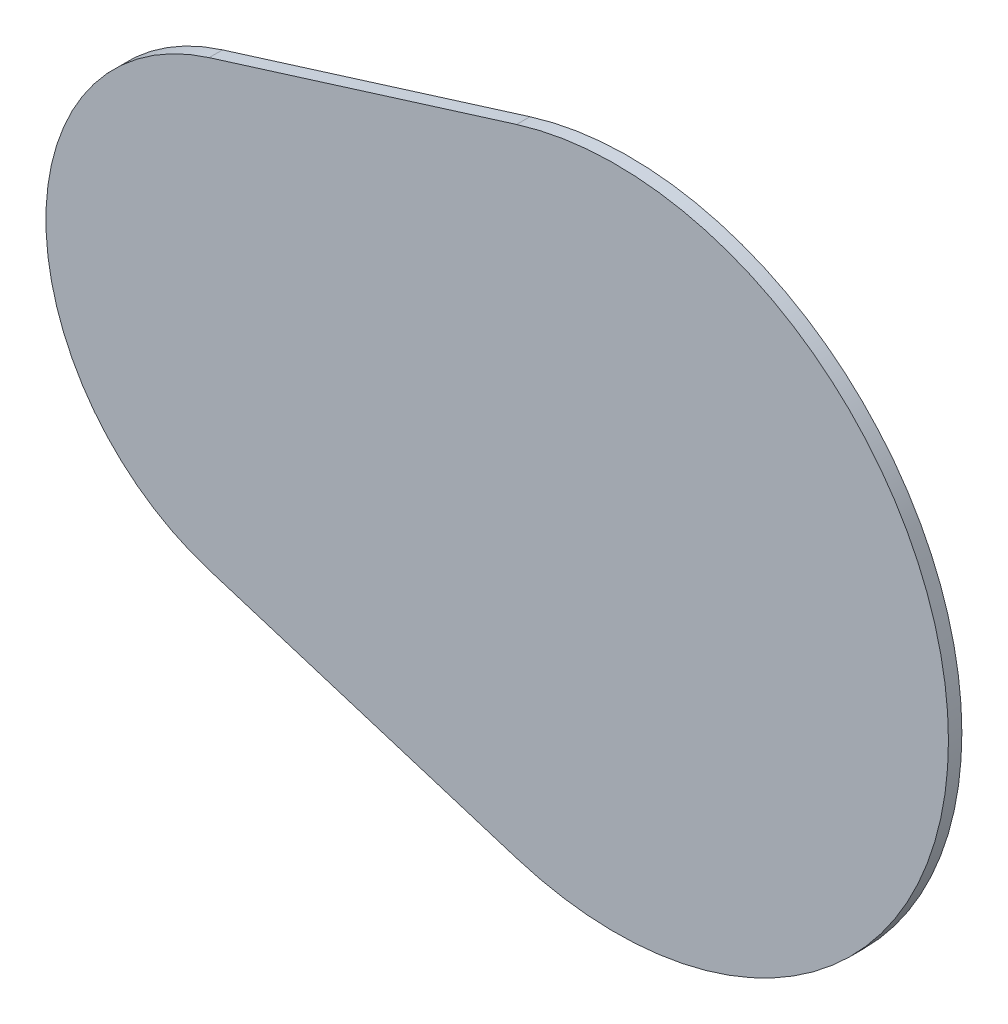
ISO-10303-21;
HEADER;
FILE_DESCRIPTION(('STEP AP214'),'2;1');
FILE_NAME('part.step','',(''),(''),'','','');
FILE_SCHEMA(('AUTOMOTIVE_DESIGN { 1 0 10303 214 1 1 1 1 }'));
ENDSEC;
DATA;
#1=APPLICATION_CONTEXT('core data for automotive mechanical design processes');
#2=APPLICATION_PROTOCOL_DEFINITION('international standard','automotive_design',2000,#1);
#3=PRODUCT_CONTEXT('',#1,'mechanical');
#4=PRODUCT('Part','Part','',(#3));
#5=PRODUCT_RELATED_PRODUCT_CATEGORY('part','',(#4));
#6=PRODUCT_DEFINITION_FORMATION('','',#4);
#7=PRODUCT_DEFINITION_CONTEXT('part definition',#1,'design');
#8=PRODUCT_DEFINITION('design','',#6,#7);
#9=PRODUCT_DEFINITION_SHAPE('','',#8);
#10=(LENGTH_UNIT() NAMED_UNIT(*) SI_UNIT(.MILLI.,.METRE.));
#11=(NAMED_UNIT(*) PLANE_ANGLE_UNIT() SI_UNIT($,.RADIAN.));
#12=(NAMED_UNIT(*) SI_UNIT($,.STERADIAN.) SOLID_ANGLE_UNIT());
#13=UNCERTAINTY_MEASURE_WITH_UNIT(LENGTH_MEASURE(1.E-05),#10,'distance_accuracy_value','');
#14=(GEOMETRIC_REPRESENTATION_CONTEXT(3) GLOBAL_UNCERTAINTY_ASSIGNED_CONTEXT((#13)) GLOBAL_UNIT_ASSIGNED_CONTEXT((#10,
#11,#12)) REPRESENTATION_CONTEXT('',''));
#15=CARTESIAN_POINT('',(0.,0.,0.));
#16=DIRECTION('',(0.,0.,1.));
#17=DIRECTION('',(1.,0.,0.));
#18=AXIS2_PLACEMENT_3D('',#15,#16,#17);
#19=CARTESIAN_POINT('',(0.,0.,1.5875));
#20=DIRECTION('',(0.,0.,-1.));
#21=DIRECTION('',(-1.,0.,0.));
#22=AXIS2_PLACEMENT_3D('',#19,#20,#21);
#23=CYLINDRICAL_SURFACE('',#22,39.37);
#24=CARTESIAN_POINT('',(0.,0.,0.));
#25=DIRECTION('',(0.,0.,1.));
#26=DIRECTION('',(1.,0.,0.));
#27=AXIS2_PLACEMENT_3D('',#24,#25,#26);
#28=CIRCLE('',#27,39.37);
#29=CARTESIAN_POINT('',(-11.7182438196972,-37.5856310547279,0.));
#30=VERTEX_POINT('',#29);
#31=CARTESIAN_POINT('',(-11.7182438196972,37.5856310547279,0.));
#32=VERTEX_POINT('',#31);
#33=EDGE_CURVE('E96',#30,#32,#28,.T.);
#34=ORIENTED_EDGE('',*,*,#33,.T.);
#35=DIRECTION('',(0.,0.,-1.));
#36=VECTOR('',#35,1.);
#37=CARTESIAN_POINT('',(-11.7182438196972,37.5856310547279,1.5875));
#38=LINE('',#37,#36);
#39=CARTESIAN_POINT('',(-11.7182438196972,37.5856310547279,1.5875));
#40=VERTEX_POINT('',#39);
#41=EDGE_CURVE('E11',#40,#32,#38,.T.);
#42=ORIENTED_EDGE('',*,*,#41,.F.);
#43=CARTESIAN_POINT('',(0.,0.,1.5875));
#44=DIRECTION('',(0.,0.,1.));
#45=DIRECTION('',(1.,0.,0.));
#46=AXIS2_PLACEMENT_3D('',#43,#44,#45);
#47=CIRCLE('',#46,39.37);
#48=CARTESIAN_POINT('',(-11.7182438196972,-37.5856310547279,1.5875));
#49=VERTEX_POINT('',#48);
#50=EDGE_CURVE('E84',#49,#40,#47,.T.);
#51=ORIENTED_EDGE('',*,*,#50,.F.);
#52=DIRECTION('',(0.,0.,-1.));
#53=VECTOR('',#52,1.);
#54=CARTESIAN_POINT('',(-11.7182438196972,-37.5856310547279,1.5875));
#55=LINE('',#54,#53);
#56=EDGE_CURVE('E92',#49,#30,#55,.T.);
#57=ORIENTED_EDGE('',*,*,#56,.T.);
#58=EDGE_LOOP('',(#34,#42,#51,#57));
#59=FACE_BOUND('',#58,.T.);
#60=ADVANCED_FACE('F33',(#59),#23,.T.);
#61=CARTESIAN_POINT('',(-11.7182438196972,37.5856310547279,1.5875));
#62=DIRECTION('',(0.297643988308285,-0.954676938143966,0.));
#63=DIRECTION('',(0.954676938143966,0.297643988308285,0.));
#64=AXIS2_PLACEMENT_3D('',#61,#62,#63);
#65=PLANE('',#64);
#66=DIRECTION('',(-0.954676938143966,-0.297643988308285,0.));
#67=VECTOR('',#66,1.);
#68=CARTESIAN_POINT('',(-11.7182438196972,37.5856310547279,0.));
#69=LINE('',#68,#67);
#70=CARTESIAN_POINT('',(-48.0914351629829,26.2453951001821,0.));
#71=VERTEX_POINT('',#70);
#72=EDGE_CURVE('E88',#32,#71,#69,.T.);
#73=ORIENTED_EDGE('',*,*,#72,.T.);
#74=DIRECTION('',(0.,0.,-1.));
#75=VECTOR('',#74,1.);
#76=CARTESIAN_POINT('',(-48.0914351629829,26.2453951001821,1.5875));
#77=LINE('',#76,#75);
#78=CARTESIAN_POINT('',(-48.0914351629829,26.2453951001821,1.5875));
#79=VERTEX_POINT('',#78);
#80=EDGE_CURVE('E41',#79,#71,#77,.T.);
#81=ORIENTED_EDGE('',*,*,#80,.F.);
#82=DIRECTION('',(-0.954676938143966,-0.297643988308285,0.));
#83=VECTOR('',#82,1.);
#84=CARTESIAN_POINT('',(-11.7182438196972,37.5856310547279,1.5875));
#85=LINE('',#84,#83);
#86=EDGE_CURVE('E79',#40,#79,#85,.T.);
#87=ORIENTED_EDGE('',*,*,#86,.F.);
#88=ORIENTED_EDGE('',*,*,#41,.T.);
#89=EDGE_LOOP('',(#73,#81,#87,#88));
#90=FACE_BOUND('',#89,.T.);
#91=ADVANCED_FACE('F87',(#90),#65,.F.);
#92=CARTESIAN_POINT('',(-39.9087884893006,0.,1.5875));
#93=DIRECTION('',(0.,0.,-1.));
#94=DIRECTION('',(-1.,0.,0.));
#95=AXIS2_PLACEMENT_3D('',#92,#93,#94);
#96=CYLINDRICAL_SURFACE('',#95,27.4913890254928);
#97=CARTESIAN_POINT('',(-39.9087884893006,0.,0.));
#98=DIRECTION('',(0.,0.,1.));
#99=DIRECTION('',(1.,0.,0.));
#100=AXIS2_PLACEMENT_3D('',#97,#98,#99);
#101=CIRCLE('',#100,27.4913890254928);
#102=CARTESIAN_POINT('',(-48.0914351629829,-26.2453951001821,0.));
#103=VERTEX_POINT('',#102);
#104=EDGE_CURVE('E66',#71,#103,#101,.T.);
#105=ORIENTED_EDGE('',*,*,#104,.T.);
#106=DIRECTION('',(0.,0.,-1.));
#107=VECTOR('',#106,1.);
#108=CARTESIAN_POINT('',(-48.0914351629829,-26.2453951001821,1.5875));
#109=LINE('',#108,#107);
#110=CARTESIAN_POINT('',(-48.0914351629829,-26.2453951001821,1.5875));
#111=VERTEX_POINT('',#110);
#112=EDGE_CURVE('E89',#111,#103,#109,.T.);
#113=ORIENTED_EDGE('',*,*,#112,.F.);
#114=CARTESIAN_POINT('',(-39.9087884893006,0.,1.5875));
#115=DIRECTION('',(0.,0.,1.));
#116=DIRECTION('',(1.,0.,0.));
#117=AXIS2_PLACEMENT_3D('',#114,#115,#116);
#118=CIRCLE('',#117,27.4913890254928);
#119=EDGE_CURVE('E82',#79,#111,#118,.T.);
#120=ORIENTED_EDGE('',*,*,#119,.F.);
#121=ORIENTED_EDGE('',*,*,#80,.T.);
#122=EDGE_LOOP('',(#105,#113,#120,#121));
#123=FACE_BOUND('',#122,.T.);
#124=ADVANCED_FACE('F90',(#123),#96,.T.);
#125=CARTESIAN_POINT('',(-11.7182438196972,-37.5856310547279,1.5875));
#126=DIRECTION('',(0.297643988308286,0.954676938143966,0.));
#127=DIRECTION('',(-0.954676938143966,0.297643988308286,0.));
#128=AXIS2_PLACEMENT_3D('',#125,#126,#127);
#129=PLANE('',#128);
#130=DIRECTION('',(0.954676938143966,-0.297643988308286,0.));
#131=VECTOR('',#130,1.);
#132=CARTESIAN_POINT('',(-11.7182438196972,-37.5856310547279,0.));
#133=LINE('',#132,#131);
#134=EDGE_CURVE('E72',#103,#30,#133,.T.);
#135=ORIENTED_EDGE('',*,*,#134,.T.);
#136=ORIENTED_EDGE('',*,*,#56,.F.);
#137=DIRECTION('',(0.954676938143966,-0.297643988308286,0.));
#138=VECTOR('',#137,1.);
#139=CARTESIAN_POINT('',(-11.7182438196972,-37.5856310547279,1.5875));
#140=LINE('',#139,#138);
#141=EDGE_CURVE('E49',#111,#49,#140,.T.);
#142=ORIENTED_EDGE('',*,*,#141,.F.);
#143=ORIENTED_EDGE('',*,*,#112,.T.);
#144=EDGE_LOOP('',(#135,#136,#142,#143));
#145=FACE_BOUND('',#144,.T.);
#146=ADVANCED_FACE('F103',(#145),#129,.F.);
#147=CARTESIAN_POINT('',(0.,0.,1.5875));
#148=DIRECTION('',(0.,0.,1.));
#149=DIRECTION('',(1.,0.,0.));
#150=AXIS2_PLACEMENT_3D('',#147,#148,#149);
#151=PLANE('',#150);
#152=ORIENTED_EDGE('',*,*,#50,.T.);
#153=ORIENTED_EDGE('',*,*,#86,.T.);
#154=ORIENTED_EDGE('',*,*,#119,.T.);
#155=ORIENTED_EDGE('',*,*,#141,.T.);
#156=EDGE_LOOP('',(#152,#153,#154,#155));
#157=FACE_BOUND('',#156,.T.);
#158=ADVANCED_FACE('F80',(#157),#151,.T.);
#159=CARTESIAN_POINT('',(0.,0.,0.));
#160=DIRECTION('',(0.,0.,1.));
#161=DIRECTION('',(1.,0.,0.));
#162=AXIS2_PLACEMENT_3D('',#159,#160,#161);
#163=PLANE('',#162);
#164=ORIENTED_EDGE('',*,*,#33,.F.);
#165=ORIENTED_EDGE('',*,*,#134,.F.);
#166=ORIENTED_EDGE('',*,*,#104,.F.);
#167=ORIENTED_EDGE('',*,*,#72,.F.);
#168=EDGE_LOOP('',(#164,#165,#166,#167));
#169=FACE_BOUND('',#168,.T.);
#170=ADVANCED_FACE('F106',(#169),#163,.F.);
#171=CLOSED_SHELL('',(#60,#91,#124,#146,#158,#170));
#172=MANIFOLD_SOLID_BREP('B2',#171);
#173=ADVANCED_BREP_SHAPE_REPRESENTATION('',(#18,#172),#14);
#174=SHAPE_DEFINITION_REPRESENTATION(#9,#173);
ENDSEC;
END-ISO-10303-21;
